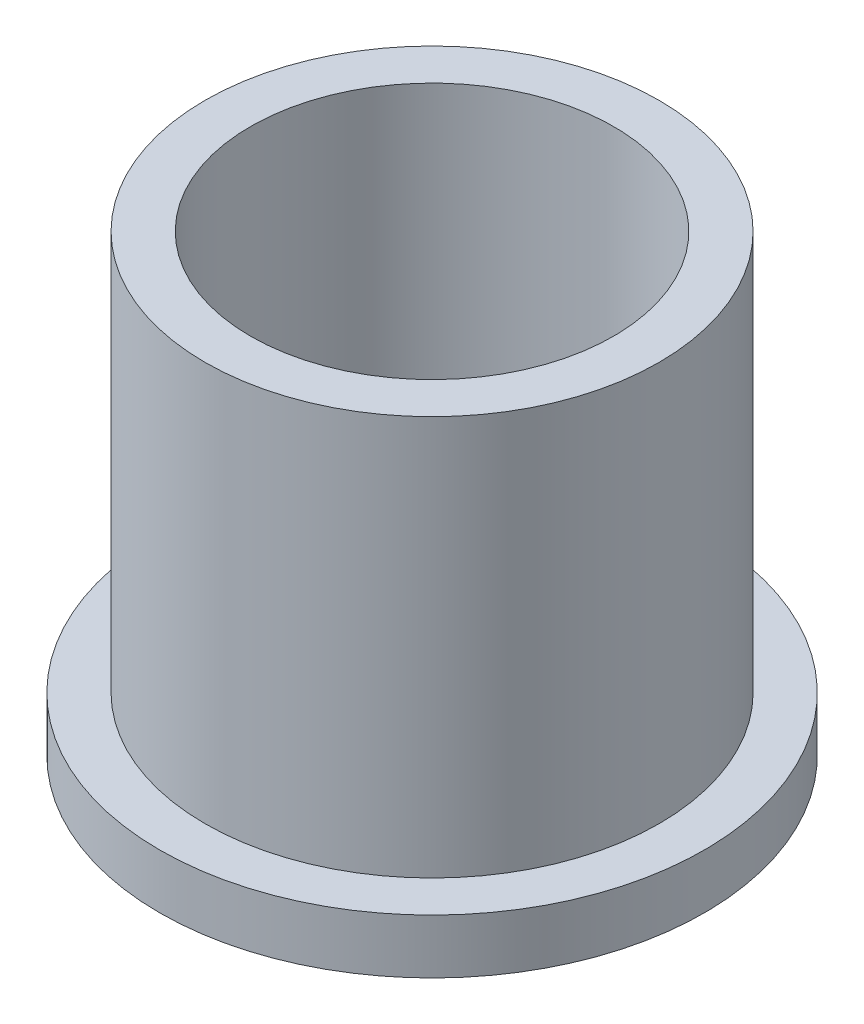
ISO-10303-21;
HEADER;
FILE_DESCRIPTION(('STEP AP214'),'2;1');
FILE_NAME('part.step','',(''),(''),'','','');
FILE_SCHEMA(('AUTOMOTIVE_DESIGN { 1 0 10303 214 1 1 1 1 }'));
ENDSEC;
DATA;
#1=APPLICATION_CONTEXT('core data for automotive mechanical design processes');
#2=APPLICATION_PROTOCOL_DEFINITION('international standard','automotive_design',2000,#1);
#3=PRODUCT_CONTEXT('',#1,'mechanical');
#4=PRODUCT('Part','Part','',(#3));
#5=PRODUCT_RELATED_PRODUCT_CATEGORY('part','',(#4));
#6=PRODUCT_DEFINITION_FORMATION('','',#4);
#7=PRODUCT_DEFINITION_CONTEXT('part definition',#1,'design');
#8=PRODUCT_DEFINITION('design','',#6,#7);
#9=PRODUCT_DEFINITION_SHAPE('','',#8);
#10=(LENGTH_UNIT() NAMED_UNIT(*) SI_UNIT(.MILLI.,.METRE.));
#11=(NAMED_UNIT(*) PLANE_ANGLE_UNIT() SI_UNIT($,.RADIAN.));
#12=(NAMED_UNIT(*) SI_UNIT($,.STERADIAN.) SOLID_ANGLE_UNIT());
#13=UNCERTAINTY_MEASURE_WITH_UNIT(LENGTH_MEASURE(1.E-05),#10,'distance_accuracy_value','');
#14=(GEOMETRIC_REPRESENTATION_CONTEXT(3) GLOBAL_UNCERTAINTY_ASSIGNED_CONTEXT((#13)) GLOBAL_UNIT_ASSIGNED_CONTEXT((#10,
#11,#12)) REPRESENTATION_CONTEXT('',''));
#15=CARTESIAN_POINT('',(0.,0.,0.));
#16=DIRECTION('',(0.,0.,1.));
#17=DIRECTION('',(1.,0.,0.));
#18=AXIS2_PLACEMENT_3D('',#15,#16,#17);
#19=CARTESIAN_POINT('',(0.,34.5625665294832,0.));
#20=DIRECTION('',(0.,1.,0.));
#21=DIRECTION('',(0.,0.,1.));
#22=AXIS2_PLACEMENT_3D('',#19,#20,#21);
#23=CYLINDRICAL_SURFACE('',#22,10.);
#24=CARTESIAN_POINT('',(0.,0.,0.));
#25=DIRECTION('',(0.,1.,0.));
#26=DIRECTION('',(0.,0.,1.));
#27=AXIS2_PLACEMENT_3D('',#24,#25,#26);
#28=CIRCLE('',#27,10.);
#29=CARTESIAN_POINT('',(0.,0.,10.));
#30=VERTEX_POINT('',#29);
#31=EDGE_CURVE('E66',#30,#30,#28,.T.);
#32=ORIENTED_EDGE('',*,*,#31,.F.);
#33=EDGE_LOOP('',(#32));
#34=FACE_BOUND('',#33,.T.);
#35=CARTESIAN_POINT('',(0.,25.,0.));
#36=DIRECTION('',(0.,1.,0.));
#37=DIRECTION('',(0.,0.,1.));
#38=AXIS2_PLACEMENT_3D('',#35,#36,#37);
#39=CIRCLE('',#38,10.);
#40=CARTESIAN_POINT('',(0.,25.,10.));
#41=VERTEX_POINT('',#40);
#42=EDGE_CURVE('E10',#41,#41,#39,.T.);
#43=ORIENTED_EDGE('',*,*,#42,.T.);
#44=EDGE_LOOP('',(#43));
#45=FACE_BOUND('',#44,.T.);
#46=ADVANCED_FACE('F39',(#34,#45),#23,.F.);
#47=CARTESIAN_POINT('',(10.,25.,0.));
#48=DIRECTION('',(0.,-1.,0.));
#49=DIRECTION('',(0.,0.,-1.));
#50=AXIS2_PLACEMENT_3D('',#47,#48,#49);
#51=PLANE('',#50);
#52=ORIENTED_EDGE('',*,*,#42,.F.);
#53=EDGE_LOOP('',(#52));
#54=FACE_BOUND('',#53,.T.);
#55=CARTESIAN_POINT('',(0.,25.,0.));
#56=DIRECTION('',(0.,1.,0.));
#57=DIRECTION('',(0.,0.,1.));
#58=AXIS2_PLACEMENT_3D('',#55,#56,#57);
#59=CIRCLE('',#58,12.5);
#60=CARTESIAN_POINT('',(0.,25.,12.5));
#61=VERTEX_POINT('',#60);
#62=EDGE_CURVE('E46',#61,#61,#59,.T.);
#63=ORIENTED_EDGE('',*,*,#62,.T.);
#64=EDGE_LOOP('',(#63));
#65=FACE_BOUND('',#64,.T.);
#66=ADVANCED_FACE('F74',(#54,#65),#51,.F.);
#67=CARTESIAN_POINT('',(0.,34.5625665294832,0.));
#68=DIRECTION('',(0.,1.,0.));
#69=DIRECTION('',(0.,0.,1.));
#70=AXIS2_PLACEMENT_3D('',#67,#68,#69);
#71=CYLINDRICAL_SURFACE('',#70,12.5);
#72=ORIENTED_EDGE('',*,*,#62,.F.);
#73=EDGE_LOOP('',(#72));
#74=FACE_BOUND('',#73,.T.);
#75=CARTESIAN_POINT('',(0.,3.,0.));
#76=DIRECTION('',(0.,1.,0.));
#77=DIRECTION('',(0.,0.,1.));
#78=AXIS2_PLACEMENT_3D('',#75,#76,#77);
#79=CIRCLE('',#78,12.5);
#80=CARTESIAN_POINT('',(0.,3.,12.5));
#81=VERTEX_POINT('',#80);
#82=EDGE_CURVE('E51',#81,#81,#79,.T.);
#83=ORIENTED_EDGE('',*,*,#82,.T.);
#84=EDGE_LOOP('',(#83));
#85=FACE_BOUND('',#84,.T.);
#86=ADVANCED_FACE('F78',(#74,#85),#71,.T.);
#87=CARTESIAN_POINT('',(12.5,3.,0.));
#88=DIRECTION('',(0.,-1.,0.));
#89=DIRECTION('',(0.,0.,-1.));
#90=AXIS2_PLACEMENT_3D('',#87,#88,#89);
#91=PLANE('',#90);
#92=ORIENTED_EDGE('',*,*,#82,.F.);
#93=EDGE_LOOP('',(#92));
#94=FACE_BOUND('',#93,.T.);
#95=CARTESIAN_POINT('',(0.,3.,0.));
#96=DIRECTION('',(0.,1.,0.));
#97=DIRECTION('',(0.,0.,1.));
#98=AXIS2_PLACEMENT_3D('',#95,#96,#97);
#99=CIRCLE('',#98,15.);
#100=CARTESIAN_POINT('',(0.,3.,15.));
#101=VERTEX_POINT('',#100);
#102=EDGE_CURVE('E56',#101,#101,#99,.T.);
#103=ORIENTED_EDGE('',*,*,#102,.T.);
#104=EDGE_LOOP('',(#103));
#105=FACE_BOUND('',#104,.T.);
#106=ADVANCED_FACE('F83',(#94,#105),#91,.F.);
#107=CARTESIAN_POINT('',(0.,34.5625665294832,0.));
#108=DIRECTION('',(0.,1.,0.));
#109=DIRECTION('',(0.,0.,1.));
#110=AXIS2_PLACEMENT_3D('',#107,#108,#109);
#111=CYLINDRICAL_SURFACE('',#110,15.);
#112=ORIENTED_EDGE('',*,*,#102,.F.);
#113=EDGE_LOOP('',(#112));
#114=FACE_BOUND('',#113,.T.);
#115=CARTESIAN_POINT('',(0.,0.,0.));
#116=DIRECTION('',(0.,1.,0.));
#117=DIRECTION('',(0.,0.,1.));
#118=AXIS2_PLACEMENT_3D('',#115,#116,#117);
#119=CIRCLE('',#118,15.);
#120=CARTESIAN_POINT('',(0.,0.,15.));
#121=VERTEX_POINT('',#120);
#122=EDGE_CURVE('E62',#121,#121,#119,.T.);
#123=ORIENTED_EDGE('',*,*,#122,.T.);
#124=EDGE_LOOP('',(#123));
#125=FACE_BOUND('',#124,.T.);
#126=ADVANCED_FACE('F89',(#114,#125),#111,.T.);
#127=CARTESIAN_POINT('',(15.,0.,0.));
#128=DIRECTION('',(0.,1.,0.));
#129=DIRECTION('',(0.,0.,1.));
#130=AXIS2_PLACEMENT_3D('',#127,#128,#129);
#131=PLANE('',#130);
#132=ORIENTED_EDGE('',*,*,#122,.F.);
#133=EDGE_LOOP('',(#132));
#134=FACE_BOUND('',#133,.T.);
#135=ORIENTED_EDGE('',*,*,#31,.T.);
#136=EDGE_LOOP('',(#135));
#137=FACE_BOUND('',#136,.T.);
#138=ADVANCED_FACE('F71',(#134,#137),#131,.F.);
#139=CLOSED_SHELL('',(#46,#66,#86,#106,#126,#138));
#140=MANIFOLD_SOLID_BREP('B2',#139);
#141=ADVANCED_BREP_SHAPE_REPRESENTATION('',(#18,#140),#14);
#142=SHAPE_DEFINITION_REPRESENTATION(#9,#141);
ENDSEC;
END-ISO-10303-21;
